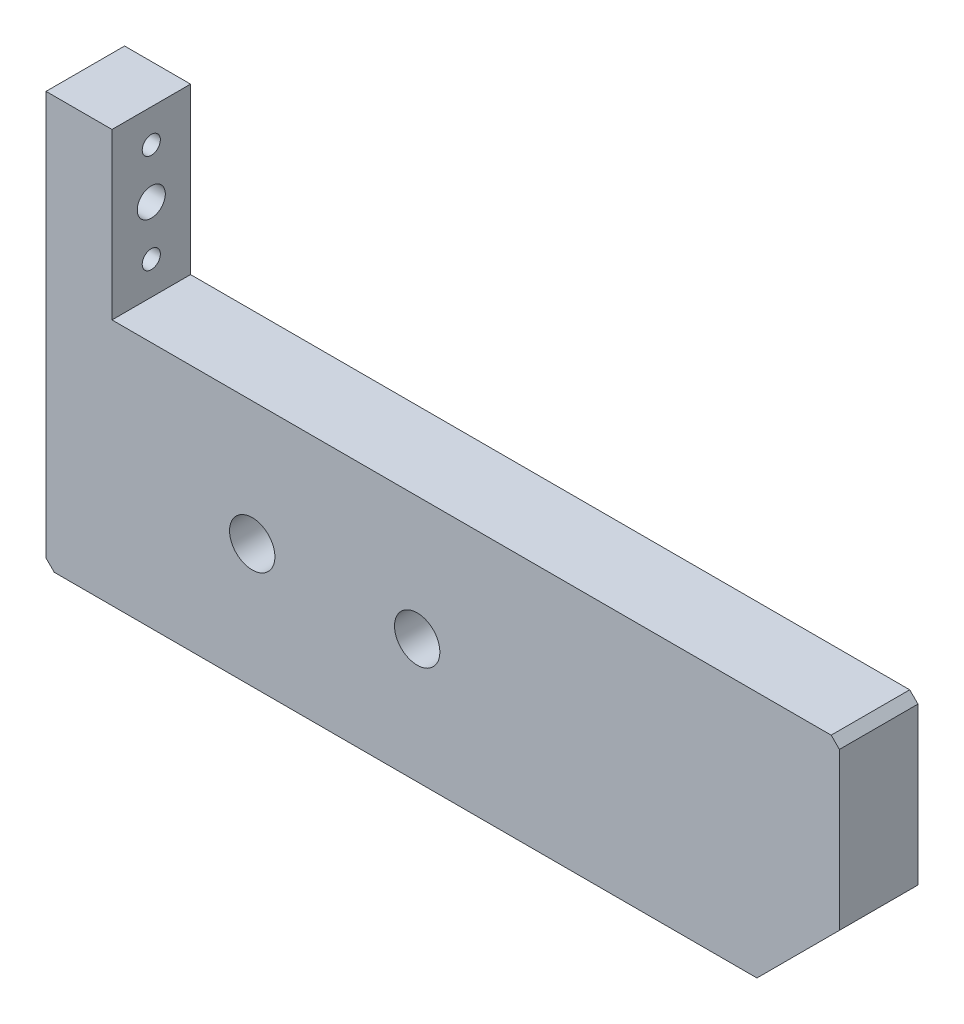
ISO-10303-21;
HEADER;
FILE_DESCRIPTION(('STEP AP214'),'2;1');
FILE_NAME('part.step','',(''),(''),'','','');
FILE_SCHEMA(('AUTOMOTIVE_DESIGN { 1 0 10303 214 1 1 1 1 }'));
ENDSEC;
DATA;
#1=APPLICATION_CONTEXT('core data for automotive mechanical design processes');
#2=APPLICATION_PROTOCOL_DEFINITION('international standard','automotive_design',2000,#1);
#3=PRODUCT_CONTEXT('',#1,'mechanical');
#4=PRODUCT('Part','Part','',(#3));
#5=PRODUCT_RELATED_PRODUCT_CATEGORY('part','',(#4));
#6=PRODUCT_DEFINITION_FORMATION('','',#4);
#7=PRODUCT_DEFINITION_CONTEXT('part definition',#1,'design');
#8=PRODUCT_DEFINITION('design','',#6,#7);
#9=PRODUCT_DEFINITION_SHAPE('','',#8);
#10=(LENGTH_UNIT() NAMED_UNIT(*) SI_UNIT(.MILLI.,.METRE.));
#11=(NAMED_UNIT(*) PLANE_ANGLE_UNIT() SI_UNIT($,.RADIAN.));
#12=(NAMED_UNIT(*) SI_UNIT($,.STERADIAN.) SOLID_ANGLE_UNIT());
#13=UNCERTAINTY_MEASURE_WITH_UNIT(LENGTH_MEASURE(1.E-05),#10,'distance_accuracy_value','');
#14=(GEOMETRIC_REPRESENTATION_CONTEXT(3) GLOBAL_UNCERTAINTY_ASSIGNED_CONTEXT((#13)) GLOBAL_UNIT_ASSIGNED_CONTEXT((#10,
#11,#12)) REPRESENTATION_CONTEXT('',''));
#15=CARTESIAN_POINT('',(0.,0.,0.));
#16=DIRECTION('',(0.,0.,1.));
#17=DIRECTION('',(1.,0.,0.));
#18=AXIS2_PLACEMENT_3D('',#15,#16,#17);
#19=CARTESIAN_POINT('',(-1070.99999999997,249.411254969558,-3.7624999989639));
#20=DIRECTION('',(-1.,0.,0.));
#21=DIRECTION('',(0.,0.,1.));
#22=AXIS2_PLACEMENT_3D('',#19,#20,#21);
#23=CYLINDRICAL_SURFACE('',#22,1.69999999995552);
#24=CARTESIAN_POINT('',(-1159.1923881554,249.411254969558,-3.7624999989639));
#25=DIRECTION('',(-1.,0.,0.));
#26=DIRECTION('',(0.,0.,1.));
#27=AXIS2_PLACEMENT_3D('',#24,#25,#26);
#28=CIRCLE('',#27,1.69999999995552);
#29=CARTESIAN_POINT('',(-1159.1923881554,249.411254969558,-2.06249999900838));
#30=VERTEX_POINT('',#29);
#31=EDGE_CURVE('E185',#30,#30,#28,.T.);
#32=ORIENTED_EDGE('',*,*,#31,.F.);
#33=EDGE_LOOP('',(#32));
#34=FACE_BOUND('',#33,.T.);
#35=CARTESIAN_POINT('',(-1164.1923881554,249.411254969558,-3.7624999989639));
#36=DIRECTION('',(-1.,0.,0.));
#37=DIRECTION('',(0.,0.,1.));
#38=AXIS2_PLACEMENT_3D('',#35,#36,#37);
#39=CIRCLE('',#38,1.69999999995552);
#40=CARTESIAN_POINT('',(-1164.1923881554,249.411254969558,-2.06249999900838));
#41=VERTEX_POINT('',#40);
#42=EDGE_CURVE('E35',#41,#41,#39,.F.);
#43=ORIENTED_EDGE('',*,*,#42,.F.);
#44=EDGE_LOOP('',(#43));
#45=FACE_BOUND('',#44,.T.);
#46=ADVANCED_FACE('F31',(#34,#45),#23,.F.);
#47=CARTESIAN_POINT('',(-1167.1923881554,259.411254969558,109.411141213756));
#48=DIRECTION('',(1.,0.,0.));
#49=DIRECTION('',(0.,0.,-1.));
#50=AXIS2_PLACEMENT_3D('',#47,#48,#49);
#51=PLANE('',#50);
#52=CARTESIAN_POINT('',(-1167.1923881554,249.411254969558,-3.7624999989639));
#53=DIRECTION('',(-1.,0.,0.));
#54=DIRECTION('',(0.,0.,1.));
#55=AXIS2_PLACEMENT_3D('',#52,#53,#54);
#56=CIRCLE('',#55,3.17499999995553);
#57=CARTESIAN_POINT('',(-1167.1923881554,249.411254969558,-0.587499999008376));
#58=VERTEX_POINT('',#57);
#59=EDGE_CURVE('E205',#58,#58,#56,.T.);
#60=ORIENTED_EDGE('',*,*,#59,.F.);
#61=EDGE_LOOP('',(#60));
#62=FACE_BOUND('',#61,.T.);
#63=CARTESIAN_POINT('',(-1167.1923881554,243.411254969558,-3.7624999989639));
#64=DIRECTION('',(-1.,0.,0.));
#65=DIRECTION('',(0.,0.,1.));
#66=AXIS2_PLACEMENT_3D('',#63,#64,#65);
#67=CIRCLE('',#66,1.09999999995552);
#68=CARTESIAN_POINT('',(-1167.1923881554,243.411254969558,-2.66249999900839));
#69=VERTEX_POINT('',#68);
#70=EDGE_CURVE('E193',#69,#69,#67,.T.);
#71=ORIENTED_EDGE('',*,*,#70,.F.);
#72=EDGE_LOOP('',(#71));
#73=FACE_BOUND('',#72,.T.);
#74=CARTESIAN_POINT('',(-1167.1923881554,255.411254969558,-3.7624999989639));
#75=DIRECTION('',(-1.,0.,0.));
#76=DIRECTION('',(0.,0.,1.));
#77=AXIS2_PLACEMENT_3D('',#74,#75,#76);
#78=CIRCLE('',#77,1.09999999995552);
#79=CARTESIAN_POINT('',(-1167.1923881554,255.411254969558,-2.66249999900839));
#80=VERTEX_POINT('',#79);
#81=EDGE_CURVE('E190',#80,#80,#78,.T.);
#82=ORIENTED_EDGE('',*,*,#81,.F.);
#83=EDGE_LOOP('',(#82));
#84=FACE_BOUND('',#83,.T.);
#85=DIRECTION('',(0.,1.,0.));
#86=VECTOR('',#85,1.);
#87=CARTESIAN_POINT('',(-1167.1923881554,259.411254969558,-8.5249999989639));
#88=LINE('',#87,#86);
#89=CARTESIAN_POINT('',(-1167.1923881554,210.411254969558,-8.5249999989639));
#90=VERTEX_POINT('',#89);
#91=CARTESIAN_POINT('',(-1167.1923881554,259.411254969558,-8.5249999989639));
#92=VERTEX_POINT('',#91);
#93=EDGE_CURVE('E104',#90,#92,#88,.T.);
#94=ORIENTED_EDGE('',*,*,#93,.F.);
#95=DIRECTION('',(0.,0.,1.));
#96=VECTOR('',#95,1.);
#97=CARTESIAN_POINT('',(-1167.1923881554,210.411254969558,109.411141213756));
#98=LINE('',#97,#96);
#99=CARTESIAN_POINT('',(-1167.1923881554,210.411254969558,1.0000000010361));
#100=VERTEX_POINT('',#99);
#101=EDGE_CURVE('E178',#90,#100,#98,.T.);
#102=ORIENTED_EDGE('',*,*,#101,.T.);
#103=DIRECTION('',(0.,-1.,0.));
#104=VECTOR('',#103,1.);
#105=CARTESIAN_POINT('',(-1167.1923881554,259.411254969558,1.0000000010361));
#106=LINE('',#105,#104);
#107=CARTESIAN_POINT('',(-1167.1923881554,259.411254969558,1.0000000010361));
#108=VERTEX_POINT('',#107);
#109=EDGE_CURVE('E122',#108,#100,#106,.T.);
#110=ORIENTED_EDGE('',*,*,#109,.F.);
#111=DIRECTION('',(0.,0.,-1.));
#112=VECTOR('',#111,1.);
#113=CARTESIAN_POINT('',(-1167.1923881554,259.411254969558,109.411141213756));
#114=LINE('',#113,#112);
#115=EDGE_CURVE('E119',#108,#92,#114,.T.);
#116=ORIENTED_EDGE('',*,*,#115,.T.);
#117=EDGE_LOOP('',(#94,#102,#110,#116));
#118=FACE_BOUND('',#117,.T.);
#119=ADVANCED_FACE('F120',(#62,#73,#84,#118),#51,.F.);
#120=CARTESIAN_POINT('',(-1159.1923881554,259.411254969558,109.411141213756));
#121=DIRECTION('',(0.,-1.,0.));
#122=DIRECTION('',(0.,0.,-1.));
#123=AXIS2_PLACEMENT_3D('',#120,#121,#122);
#124=PLANE('',#123);
#125=DIRECTION('',(-1.,0.,0.));
#126=VECTOR('',#125,1.);
#127=CARTESIAN_POINT('',(-1159.1923881554,259.411254969558,1.0000000010361));
#128=LINE('',#127,#126);
#129=CARTESIAN_POINT('',(-1159.1923881554,259.411254969558,1.0000000010361));
#130=VERTEX_POINT('',#129);
#131=EDGE_CURVE('E147',#130,#108,#128,.T.);
#132=ORIENTED_EDGE('',*,*,#131,.F.);
#133=DIRECTION('',(0.,0.,-1.));
#134=VECTOR('',#133,1.);
#135=CARTESIAN_POINT('',(-1159.1923881554,259.411254969558,109.411141213756));
#136=LINE('',#135,#134);
#137=CARTESIAN_POINT('',(-1159.1923881554,259.411254969558,-8.5249999989639));
#138=VERTEX_POINT('',#137);
#139=EDGE_CURVE('E125',#130,#138,#136,.T.);
#140=ORIENTED_EDGE('',*,*,#139,.T.);
#141=DIRECTION('',(1.,0.,0.));
#142=VECTOR('',#141,1.);
#143=CARTESIAN_POINT('',(-1159.1923881554,259.411254969558,-8.5249999989639));
#144=LINE('',#143,#142);
#145=EDGE_CURVE('E111',#92,#138,#144,.T.);
#146=ORIENTED_EDGE('',*,*,#145,.F.);
#147=ORIENTED_EDGE('',*,*,#115,.F.);
#148=EDGE_LOOP('',(#132,#140,#146,#147));
#149=FACE_BOUND('',#148,.T.);
#150=ADVANCED_FACE('F128',(#149),#124,.F.);
#151=CARTESIAN_POINT('',(-1159.1923881554,239.411254969558,109.411141213756));
#152=DIRECTION('',(-1.,0.,0.));
#153=DIRECTION('',(0.,0.,1.));
#154=AXIS2_PLACEMENT_3D('',#151,#152,#153);
#155=PLANE('',#154);
#156=CARTESIAN_POINT('',(-1159.1923881554,243.411254969558,-3.7624999989639));
#157=DIRECTION('',(-1.,0.,0.));
#158=DIRECTION('',(0.,0.,1.));
#159=AXIS2_PLACEMENT_3D('',#156,#157,#158);
#160=CIRCLE('',#159,1.09999999995552);
#161=CARTESIAN_POINT('',(-1159.1923881554,243.411254969558,-2.66249999900839));
#162=VERTEX_POINT('',#161);
#163=EDGE_CURVE('E191',#162,#162,#160,.T.);
#164=ORIENTED_EDGE('',*,*,#163,.T.);
#165=EDGE_LOOP('',(#164));
#166=FACE_BOUND('',#165,.T.);
#167=CARTESIAN_POINT('',(-1159.1923881554,255.411254969558,-3.7624999989639));
#168=DIRECTION('',(-1.,0.,0.));
#169=DIRECTION('',(0.,0.,1.));
#170=AXIS2_PLACEMENT_3D('',#167,#168,#169);
#171=CIRCLE('',#170,1.09999999995552);
#172=CARTESIAN_POINT('',(-1159.1923881554,255.411254969558,-2.66249999900839));
#173=VERTEX_POINT('',#172);
#174=EDGE_CURVE('E188',#173,#173,#171,.T.);
#175=ORIENTED_EDGE('',*,*,#174,.T.);
#176=EDGE_LOOP('',(#175));
#177=FACE_BOUND('',#176,.T.);
#178=ORIENTED_EDGE('',*,*,#31,.T.);
#179=EDGE_LOOP('',(#178));
#180=FACE_BOUND('',#179,.T.);
#181=DIRECTION('',(0.,1.,0.));
#182=VECTOR('',#181,1.);
#183=CARTESIAN_POINT('',(-1159.1923881554,239.411254969558,1.0000000010361));
#184=LINE('',#183,#182);
#185=CARTESIAN_POINT('',(-1159.1923881554,239.411254969558,1.0000000010361));
#186=VERTEX_POINT('',#185);
#187=EDGE_CURVE('E149',#186,#130,#184,.T.);
#188=ORIENTED_EDGE('',*,*,#187,.F.);
#189=DIRECTION('',(0.,0.,-1.));
#190=VECTOR('',#189,1.);
#191=CARTESIAN_POINT('',(-1159.1923881554,239.411254969558,109.411141213756));
#192=LINE('',#191,#190);
#193=CARTESIAN_POINT('',(-1159.1923881554,239.411254969558,-8.5249999989639));
#194=VERTEX_POINT('',#193);
#195=EDGE_CURVE('E158',#186,#194,#192,.T.);
#196=ORIENTED_EDGE('',*,*,#195,.T.);
#197=DIRECTION('',(0.,-1.,0.));
#198=VECTOR('',#197,1.);
#199=CARTESIAN_POINT('',(-1159.1923881554,239.411254969558,-8.5249999989639));
#200=LINE('',#199,#198);
#201=EDGE_CURVE('E130',#138,#194,#200,.T.);
#202=ORIENTED_EDGE('',*,*,#201,.F.);
#203=ORIENTED_EDGE('',*,*,#139,.F.);
#204=EDGE_LOOP('',(#188,#196,#202,#203));
#205=FACE_BOUND('',#204,.T.);
#206=ADVANCED_FACE('F258',(#166,#177,#180,#205),#155,.F.);
#207=CARTESIAN_POINT('',(-1070.99999999997,239.411254969558,109.411141213756));
#208=DIRECTION('',(0.,-1.,0.));
#209=DIRECTION('',(1.,0.,0.));
#210=AXIS2_PLACEMENT_3D('',#207,#208,#209);
#211=PLANE('',#210);
#212=DIRECTION('',(-1.,0.,0.));
#213=VECTOR('',#212,1.);
#214=CARTESIAN_POINT('',(-1070.99999999997,239.411254969558,1.0000000010361));
#215=LINE('',#214,#213);
#216=CARTESIAN_POINT('',(-1071.99999999997,239.411254969558,1.0000000010361));
#217=VERTEX_POINT('',#216);
#218=EDGE_CURVE('E152',#217,#186,#215,.T.);
#219=ORIENTED_EDGE('',*,*,#218,.F.);
#220=DIRECTION('',(0.,0.,-1.));
#221=VECTOR('',#220,1.);
#222=CARTESIAN_POINT('',(-1071.99999999997,239.411254969558,109.411141213756));
#223=LINE('',#222,#221);
#224=CARTESIAN_POINT('',(-1071.99999999997,239.411254969558,-8.5249999989639));
#225=VERTEX_POINT('',#224);
#226=EDGE_CURVE('E40',#217,#225,#223,.T.);
#227=ORIENTED_EDGE('',*,*,#226,.T.);
#228=DIRECTION('',(1.,0.,0.));
#229=VECTOR('',#228,1.);
#230=CARTESIAN_POINT('',(-1070.99999999997,239.411254969558,-8.5249999989639));
#231=LINE('',#230,#229);
#232=EDGE_CURVE('E132',#194,#225,#231,.T.);
#233=ORIENTED_EDGE('',*,*,#232,.F.);
#234=ORIENTED_EDGE('',*,*,#195,.F.);
#235=EDGE_LOOP('',(#219,#227,#233,#234));
#236=FACE_BOUND('',#235,.T.);
#237=ADVANCED_FACE('F214',(#236),#211,.F.);
#238=CARTESIAN_POINT('',(-1070.99999999997,209.411254969558,109.411141213756));
#239=DIRECTION('',(-1.,0.,0.));
#240=DIRECTION('',(0.,0.,1.));
#241=AXIS2_PLACEMENT_3D('',#238,#239,#240);
#242=PLANE('',#241);
#243=DIRECTION('',(0.,-1.,0.));
#244=VECTOR('',#243,1.);
#245=CARTESIAN_POINT('',(-1070.99999999997,209.411254969558,-8.5249999989639));
#246=LINE('',#245,#244);
#247=CARTESIAN_POINT('',(-1070.99999999997,238.411254969558,-8.5249999989639));
#248=VERTEX_POINT('',#247);
#249=CARTESIAN_POINT('',(-1070.99999999997,219.411254969558,-8.5249999989639));
#250=VERTEX_POINT('',#249);
#251=EDGE_CURVE('E137',#248,#250,#246,.T.);
#252=ORIENTED_EDGE('',*,*,#251,.F.);
#253=DIRECTION('',(0.,0.,1.));
#254=VECTOR('',#253,1.);
#255=CARTESIAN_POINT('',(-1070.99999999997,238.411254969558,109.411141213756));
#256=LINE('',#255,#254);
#257=CARTESIAN_POINT('',(-1070.99999999997,238.411254969558,1.0000000010361));
#258=VERTEX_POINT('',#257);
#259=EDGE_CURVE('E11',#248,#258,#256,.T.);
#260=ORIENTED_EDGE('',*,*,#259,.T.);
#261=DIRECTION('',(0.,1.,0.));
#262=VECTOR('',#261,1.);
#263=CARTESIAN_POINT('',(-1070.99999999997,209.411254969558,1.0000000010361));
#264=LINE('',#263,#262);
#265=CARTESIAN_POINT('',(-1070.99999999997,219.411254969558,1.0000000010361));
#266=VERTEX_POINT('',#265);
#267=EDGE_CURVE('E154',#266,#258,#264,.T.);
#268=ORIENTED_EDGE('',*,*,#267,.F.);
#269=DIRECTION('',(0.,0.,-1.));
#270=VECTOR('',#269,1.);
#271=CARTESIAN_POINT('',(-1070.99999999997,219.411254969558,109.411141213756));
#272=LINE('',#271,#270);
#273=EDGE_CURVE('E160',#266,#250,#272,.T.);
#274=ORIENTED_EDGE('',*,*,#273,.T.);
#275=EDGE_LOOP('',(#252,#260,#268,#274));
#276=FACE_BOUND('',#275,.T.);
#277=ADVANCED_FACE('F263',(#276),#242,.F.);
#278=CARTESIAN_POINT('',(-1167.1923881554,209.411254969558,109.411141213756));
#279=DIRECTION('',(0.,1.,0.));
#280=DIRECTION('',(-1.,0.,0.));
#281=AXIS2_PLACEMENT_3D('',#278,#279,#280);
#282=PLANE('',#281);
#283=DIRECTION('',(1.,0.,0.));
#284=VECTOR('',#283,1.);
#285=CARTESIAN_POINT('',(-1167.1923881554,209.411254969558,1.0000000010361));
#286=LINE('',#285,#284);
#287=CARTESIAN_POINT('',(-1166.1923881554,209.411254969558,1.0000000010361));
#288=VERTEX_POINT('',#287);
#289=CARTESIAN_POINT('',(-1080.99999999997,209.411254969558,1.0000000010361));
#290=VERTEX_POINT('',#289);
#291=EDGE_CURVE('E126',#288,#290,#286,.T.);
#292=ORIENTED_EDGE('',*,*,#291,.F.);
#293=DIRECTION('',(0.,0.,-1.));
#294=VECTOR('',#293,1.);
#295=CARTESIAN_POINT('',(-1166.1923881554,209.411254969558,109.411141213756));
#296=LINE('',#295,#294);
#297=CARTESIAN_POINT('',(-1166.1923881554,209.411254969558,-8.5249999989639));
#298=VERTEX_POINT('',#297);
#299=EDGE_CURVE('E172',#288,#298,#296,.T.);
#300=ORIENTED_EDGE('',*,*,#299,.T.);
#301=DIRECTION('',(-1.,0.,0.));
#302=VECTOR('',#301,1.);
#303=CARTESIAN_POINT('',(-1167.1923881554,209.411254969558,-8.5249999989639));
#304=LINE('',#303,#302);
#305=CARTESIAN_POINT('',(-1080.99999999997,209.411254969558,-8.5249999989639));
#306=VERTEX_POINT('',#305);
#307=EDGE_CURVE('E116',#306,#298,#304,.T.);
#308=ORIENTED_EDGE('',*,*,#307,.F.);
#309=DIRECTION('',(0.,0.,1.));
#310=VECTOR('',#309,1.);
#311=CARTESIAN_POINT('',(-1080.99999999997,209.411254969558,109.411141213756));
#312=LINE('',#311,#310);
#313=EDGE_CURVE('E167',#306,#290,#312,.T.);
#314=ORIENTED_EDGE('',*,*,#313,.T.);
#315=EDGE_LOOP('',(#292,#300,#308,#314));
#316=FACE_BOUND('',#315,.T.);
#317=ADVANCED_FACE('F253',(#316),#282,.F.);
#318=CARTESIAN_POINT('',(-1122.1923881554,224.411254969558,109.411141213756));
#319=DIRECTION('',(0.,0.,-1.));
#320=DIRECTION('',(-1.,0.,0.));
#321=AXIS2_PLACEMENT_3D('',#318,#319,#320);
#322=CYLINDRICAL_SURFACE('',#321,2.74999999999993);
#323=CARTESIAN_POINT('',(-1122.1923881554,224.411254969558,1.0000000010361));
#324=DIRECTION('',(0.,0.,1.));
#325=DIRECTION('',(1.,0.,0.));
#326=AXIS2_PLACEMENT_3D('',#323,#324,#325);
#327=CIRCLE('',#326,2.74999999999993);
#328=CARTESIAN_POINT('',(-1119.4423881554,224.411254969558,1.0000000010361));
#329=VERTEX_POINT('',#328);
#330=EDGE_CURVE('E142',#329,#329,#327,.T.);
#331=ORIENTED_EDGE('',*,*,#330,.T.);
#332=EDGE_LOOP('',(#331));
#333=FACE_BOUND('',#332,.T.);
#334=CARTESIAN_POINT('',(-1122.1923881554,224.411254969558,-8.5249999989639));
#335=DIRECTION('',(0.,0.,1.));
#336=DIRECTION('',(1.,0.,0.));
#337=AXIS2_PLACEMENT_3D('',#334,#335,#336);
#338=CIRCLE('',#337,2.74999999999993);
#339=CARTESIAN_POINT('',(-1119.4423881554,224.411254969558,-8.5249999989639));
#340=VERTEX_POINT('',#339);
#341=EDGE_CURVE('E141',#340,#340,#338,.F.);
#342=ORIENTED_EDGE('',*,*,#341,.T.);
#343=EDGE_LOOP('',(#342));
#344=FACE_BOUND('',#343,.T.);
#345=ADVANCED_FACE('F250',(#333,#344),#322,.F.);
#346=CARTESIAN_POINT('',(-1142.1923881554,224.411254969558,109.411141213756));
#347=DIRECTION('',(0.,0.,-1.));
#348=DIRECTION('',(-1.,0.,0.));
#349=AXIS2_PLACEMENT_3D('',#346,#347,#348);
#350=CYLINDRICAL_SURFACE('',#349,2.74999999999993);
#351=CARTESIAN_POINT('',(-1142.1923881554,224.411254969558,1.0000000010361));
#352=DIRECTION('',(0.,0.,1.));
#353=DIRECTION('',(1.,0.,0.));
#354=AXIS2_PLACEMENT_3D('',#351,#352,#353);
#355=CIRCLE('',#354,2.74999999999993);
#356=CARTESIAN_POINT('',(-1139.4423881554,224.411254969558,1.0000000010361));
#357=VERTEX_POINT('',#356);
#358=EDGE_CURVE('E145',#357,#357,#355,.T.);
#359=ORIENTED_EDGE('',*,*,#358,.T.);
#360=EDGE_LOOP('',(#359));
#361=FACE_BOUND('',#360,.T.);
#362=CARTESIAN_POINT('',(-1142.1923881554,224.411254969558,-8.5249999989639));
#363=DIRECTION('',(0.,0.,1.));
#364=DIRECTION('',(1.,0.,0.));
#365=AXIS2_PLACEMENT_3D('',#362,#363,#364);
#366=CIRCLE('',#365,2.74999999999993);
#367=CARTESIAN_POINT('',(-1139.4423881554,224.411254969558,-8.5249999989639));
#368=VERTEX_POINT('',#367);
#369=EDGE_CURVE('E138',#368,#368,#366,.F.);
#370=ORIENTED_EDGE('',*,*,#369,.T.);
#371=EDGE_LOOP('',(#370));
#372=FACE_BOUND('',#371,.T.);
#373=ADVANCED_FACE('F246',(#361,#372),#350,.F.);
#374=CARTESIAN_POINT('',(-1075.99999999998,258.718866814132,1.0000000010361));
#375=DIRECTION('',(0.,0.,1.));
#376=DIRECTION('',(1.,0.,0.));
#377=AXIS2_PLACEMENT_3D('',#374,#375,#376);
#378=PLANE('',#377);
#379=ORIENTED_EDGE('',*,*,#358,.F.);
#380=EDGE_LOOP('',(#379));
#381=FACE_BOUND('',#380,.T.);
#382=ORIENTED_EDGE('',*,*,#330,.F.);
#383=EDGE_LOOP('',(#382));
#384=FACE_BOUND('',#383,.T.);
#385=ORIENTED_EDGE('',*,*,#109,.T.);
#386=DIRECTION('',(-0.707106781186557,0.707106781186538,0.));
#387=VECTOR('',#386,1.);
#388=CARTESIAN_POINT('',(-1145.74999999997,188.968866814131,1.0000000010361));
#389=LINE('',#388,#387);
#390=EDGE_CURVE('E181',#100,#288,#389,.F.);
#391=ORIENTED_EDGE('',*,*,#390,.T.);
#392=ORIENTED_EDGE('',*,*,#291,.T.);
#393=DIRECTION('',(-0.707106781186549,-0.707106781186546,0.));
#394=VECTOR('',#393,1.);
#395=CARTESIAN_POINT('',(-1053.84619407769,236.565060891844,1.0000000010361));
#396=LINE('',#395,#394);
#397=EDGE_CURVE('E170',#290,#266,#396,.F.);
#398=ORIENTED_EDGE('',*,*,#397,.T.);
#399=ORIENTED_EDGE('',*,*,#267,.T.);
#400=DIRECTION('',(0.707106781186508,-0.707106781186587,0.));
#401=VECTOR('',#400,1.);
#402=CARTESIAN_POINT('',(-1083.65380592226,251.065060891847,1.0000000010361));
#403=LINE('',#402,#401);
#404=EDGE_CURVE('E48',#258,#217,#403,.F.);
#405=ORIENTED_EDGE('',*,*,#404,.T.);
#406=ORIENTED_EDGE('',*,*,#218,.T.);
#407=ORIENTED_EDGE('',*,*,#187,.T.);
#408=ORIENTED_EDGE('',*,*,#131,.T.);
#409=EDGE_LOOP('',(#385,#391,#392,#398,#399,#405,#406,#407,#408));
#410=FACE_BOUND('',#409,.T.);
#411=ADVANCED_FACE('F243',(#381,#384,#410),#378,.T.);
#412=CARTESIAN_POINT('',(-1075.99999999998,258.718866814132,-8.5249999989639));
#413=DIRECTION('',(0.,0.,1.));
#414=DIRECTION('',(1.,0.,0.));
#415=AXIS2_PLACEMENT_3D('',#412,#413,#414);
#416=PLANE('',#415);
#417=ORIENTED_EDGE('',*,*,#307,.T.);
#418=DIRECTION('',(0.707106781186557,-0.707106781186538,0.));
#419=VECTOR('',#418,1.);
#420=CARTESIAN_POINT('',(-1166.1923881554,209.411254969558,-8.5249999989639));
#421=LINE('',#420,#419);
#422=EDGE_CURVE('E113',#298,#90,#421,.F.);
#423=ORIENTED_EDGE('',*,*,#422,.T.);
#424=ORIENTED_EDGE('',*,*,#93,.T.);
#425=ORIENTED_EDGE('',*,*,#145,.T.);
#426=ORIENTED_EDGE('',*,*,#201,.T.);
#427=ORIENTED_EDGE('',*,*,#232,.T.);
#428=DIRECTION('',(-0.707106781186508,0.707106781186587,0.));
#429=VECTOR('',#428,1.);
#430=CARTESIAN_POINT('',(-1071.99999999997,239.411254969558,-8.5249999989639));
#431=LINE('',#430,#429);
#432=EDGE_CURVE('E175',#225,#248,#431,.F.);
#433=ORIENTED_EDGE('',*,*,#432,.T.);
#434=ORIENTED_EDGE('',*,*,#251,.T.);
#435=DIRECTION('',(0.707106781186549,0.707106781186546,0.));
#436=VECTOR('',#435,1.);
#437=CARTESIAN_POINT('',(-1070.99999999997,219.411254969558,-8.5249999989639));
#438=LINE('',#437,#436);
#439=EDGE_CURVE('E165',#250,#306,#438,.F.);
#440=ORIENTED_EDGE('',*,*,#439,.T.);
#441=EDGE_LOOP('',(#417,#423,#424,#425,#426,#427,#433,#434,#440));
#442=FACE_BOUND('',#441,.T.);
#443=ORIENTED_EDGE('',*,*,#369,.F.);
#444=EDGE_LOOP('',(#443));
#445=FACE_BOUND('',#444,.T.);
#446=ORIENTED_EDGE('',*,*,#341,.F.);
#447=EDGE_LOOP('',(#446));
#448=FACE_BOUND('',#447,.T.);
#449=ADVANCED_FACE('F107',(#442,#445,#448),#416,.F.);
#450=CARTESIAN_POINT('',(-1070.99999999997,219.411254969558,109.411141213756));
#451=DIRECTION('',(-0.707106781186546,0.707106781186549,0.));
#452=DIRECTION('',(-0.707106781186549,-0.707106781186546,0.));
#453=AXIS2_PLACEMENT_3D('',#450,#451,#452);
#454=PLANE('',#453);
#455=ORIENTED_EDGE('',*,*,#397,.F.);
#456=ORIENTED_EDGE('',*,*,#313,.F.);
#457=ORIENTED_EDGE('',*,*,#439,.F.);
#458=ORIENTED_EDGE('',*,*,#273,.F.);
#459=EDGE_LOOP('',(#455,#456,#457,#458));
#460=FACE_BOUND('',#459,.T.);
#461=ADVANCED_FACE('F227',(#460),#454,.F.);
#462=CARTESIAN_POINT('',(-1166.1923881554,209.411254969558,109.411141213756));
#463=DIRECTION('',(0.707106781186538,0.707106781186557,0.));
#464=DIRECTION('',(-0.707106781186557,0.707106781186538,0.));
#465=AXIS2_PLACEMENT_3D('',#462,#463,#464);
#466=PLANE('',#465);
#467=ORIENTED_EDGE('',*,*,#390,.F.);
#468=ORIENTED_EDGE('',*,*,#101,.F.);
#469=ORIENTED_EDGE('',*,*,#422,.F.);
#470=ORIENTED_EDGE('',*,*,#299,.F.);
#471=EDGE_LOOP('',(#467,#468,#469,#470));
#472=FACE_BOUND('',#471,.T.);
#473=ADVANCED_FACE('F219',(#472),#466,.F.);
#474=CARTESIAN_POINT('',(-1071.99999999997,239.411254969558,109.411141213756));
#475=DIRECTION('',(-0.707106781186587,-0.707106781186508,0.));
#476=DIRECTION('',(0.707106781186508,-0.707106781186587,0.));
#477=AXIS2_PLACEMENT_3D('',#474,#475,#476);
#478=PLANE('',#477);
#479=ORIENTED_EDGE('',*,*,#404,.F.);
#480=ORIENTED_EDGE('',*,*,#259,.F.);
#481=ORIENTED_EDGE('',*,*,#432,.F.);
#482=ORIENTED_EDGE('',*,*,#226,.F.);
#483=EDGE_LOOP('',(#479,#480,#481,#482));
#484=FACE_BOUND('',#483,.T.);
#485=ADVANCED_FACE('F33',(#484),#478,.F.);
#486=CARTESIAN_POINT('',(-1070.99999999997,255.411254969558,-3.7624999989639));
#487=DIRECTION('',(-1.,0.,0.));
#488=DIRECTION('',(0.,0.,1.));
#489=AXIS2_PLACEMENT_3D('',#486,#487,#488);
#490=CYLINDRICAL_SURFACE('',#489,1.09999999995552);
#491=ORIENTED_EDGE('',*,*,#81,.T.);
#492=EDGE_LOOP('',(#491));
#493=FACE_BOUND('',#492,.T.);
#494=ORIENTED_EDGE('',*,*,#174,.F.);
#495=EDGE_LOOP('',(#494));
#496=FACE_BOUND('',#495,.T.);
#497=ADVANCED_FACE('F218',(#493,#496),#490,.F.);
#498=CARTESIAN_POINT('',(-1070.99999999997,243.411254969558,-3.7624999989639));
#499=DIRECTION('',(-1.,0.,0.));
#500=DIRECTION('',(0.,0.,1.));
#501=AXIS2_PLACEMENT_3D('',#498,#499,#500);
#502=CYLINDRICAL_SURFACE('',#501,1.09999999995552);
#503=ORIENTED_EDGE('',*,*,#70,.T.);
#504=EDGE_LOOP('',(#503));
#505=FACE_BOUND('',#504,.T.);
#506=ORIENTED_EDGE('',*,*,#163,.F.);
#507=EDGE_LOOP('',(#506));
#508=FACE_BOUND('',#507,.T.);
#509=ADVANCED_FACE('F224',(#505,#508),#502,.F.);
#510=CARTESIAN_POINT('',(-1164.1923881554,249.411254969558,-3.7624999989639));
#511=DIRECTION('',(-1.,0.,0.));
#512=DIRECTION('',(0.,0.,1.));
#513=AXIS2_PLACEMENT_3D('',#510,#511,#512);
#514=PLANE('',#513);
#515=CARTESIAN_POINT('',(-1164.1923881554,249.411254969558,-3.7624999989639));
#516=DIRECTION('',(-1.,0.,0.));
#517=DIRECTION('',(0.,0.,1.));
#518=AXIS2_PLACEMENT_3D('',#515,#516,#517);
#519=CIRCLE('',#518,3.17499999995553);
#520=CARTESIAN_POINT('',(-1164.1923881554,249.411254969558,-0.587499999008376));
#521=VERTEX_POINT('',#520);
#522=EDGE_CURVE('E203',#521,#521,#519,.T.);
#523=ORIENTED_EDGE('',*,*,#522,.T.);
#524=EDGE_LOOP('',(#523));
#525=FACE_BOUND('',#524,.T.);
#526=ORIENTED_EDGE('',*,*,#42,.T.);
#527=EDGE_LOOP('',(#526));
#528=FACE_BOUND('',#527,.T.);
#529=ADVANCED_FACE('F320',(#525,#528),#514,.T.);
#530=CARTESIAN_POINT('',(-1164.1923881554,249.411254969558,-3.7624999989639));
#531=DIRECTION('',(-1.,0.,0.));
#532=DIRECTION('',(0.,0.,1.));
#533=AXIS2_PLACEMENT_3D('',#530,#531,#532);
#534=CYLINDRICAL_SURFACE('',#533,3.17499999995553);
#535=ORIENTED_EDGE('',*,*,#522,.F.);
#536=EDGE_LOOP('',(#535));
#537=FACE_BOUND('',#536,.T.);
#538=ORIENTED_EDGE('',*,*,#59,.T.);
#539=EDGE_LOOP('',(#538));
#540=FACE_BOUND('',#539,.T.);
#541=ADVANCED_FACE('F339',(#537,#540),#534,.F.);
#542=CLOSED_SHELL('',(#46,#119,#150,#206,#237,#277,#317,#345,#373,#411,#449,#461,#473,#485,#497,
#509,#529,#541));
#543=MANIFOLD_SOLID_BREP('B2',#542);
#544=ADVANCED_BREP_SHAPE_REPRESENTATION('',(#18,#543),#14);
#545=SHAPE_DEFINITION_REPRESENTATION(#9,#544);
ENDSEC;
END-ISO-10303-21;
